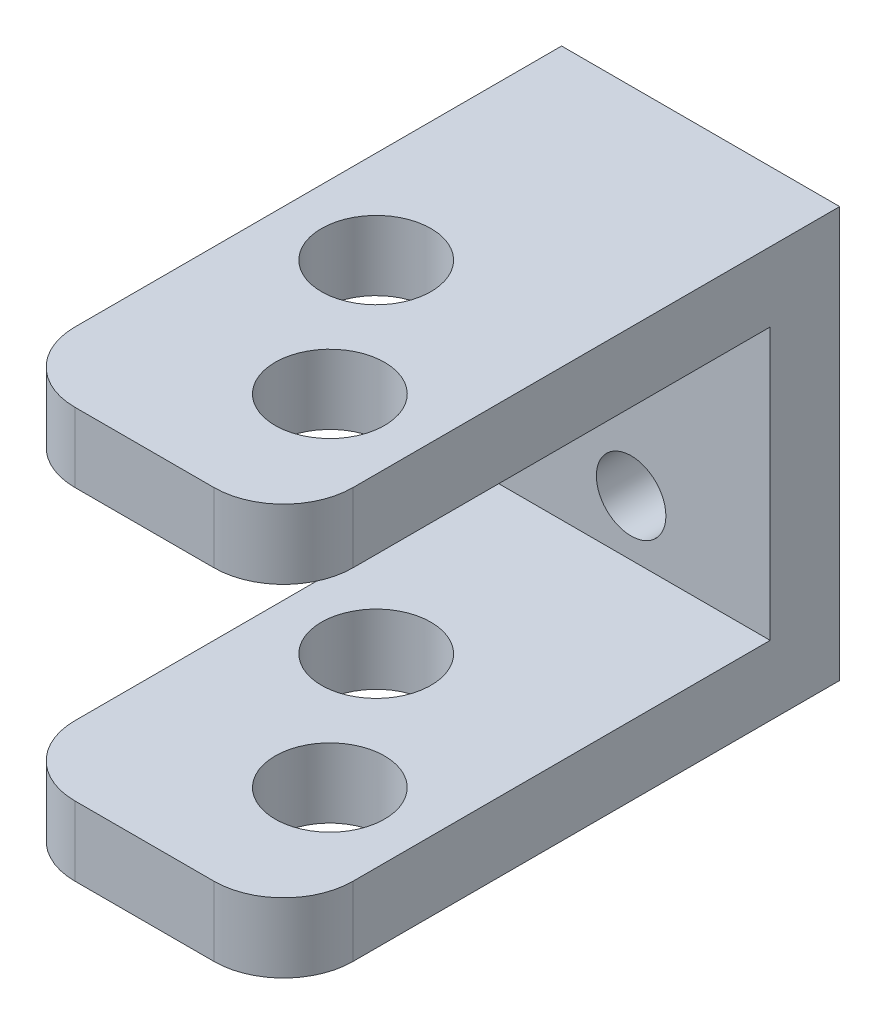
ISO-10303-21;
HEADER;
FILE_DESCRIPTION(('STEP AP214'),'2;1');
FILE_NAME('part.step','',(''),(''),'','','');
FILE_SCHEMA(('AUTOMOTIVE_DESIGN { 1 0 10303 214 1 1 1 1 }'));
ENDSEC;
DATA;
#1=APPLICATION_CONTEXT('core data for automotive mechanical design processes');
#2=APPLICATION_PROTOCOL_DEFINITION('international standard','automotive_design',2000,#1);
#3=PRODUCT_CONTEXT('',#1,'mechanical');
#4=PRODUCT('Part','Part','',(#3));
#5=PRODUCT_RELATED_PRODUCT_CATEGORY('part','',(#4));
#6=PRODUCT_DEFINITION_FORMATION('','',#4);
#7=PRODUCT_DEFINITION_CONTEXT('part definition',#1,'design');
#8=PRODUCT_DEFINITION('design','',#6,#7);
#9=PRODUCT_DEFINITION_SHAPE('','',#8);
#10=(LENGTH_UNIT() NAMED_UNIT(*) SI_UNIT(.MILLI.,.METRE.));
#11=(NAMED_UNIT(*) PLANE_ANGLE_UNIT() SI_UNIT($,.RADIAN.));
#12=(NAMED_UNIT(*) SI_UNIT($,.STERADIAN.) SOLID_ANGLE_UNIT());
#13=UNCERTAINTY_MEASURE_WITH_UNIT(LENGTH_MEASURE(1.E-05),#10,'distance_accuracy_value','');
#14=(GEOMETRIC_REPRESENTATION_CONTEXT(3) GLOBAL_UNCERTAINTY_ASSIGNED_CONTEXT((#13)) GLOBAL_UNIT_ASSIGNED_CONTEXT((#10,
#11,#12)) REPRESENTATION_CONTEXT('',''));
#15=CARTESIAN_POINT('',(0.,0.,0.));
#16=DIRECTION('',(0.,0.,1.));
#17=DIRECTION('',(1.,0.,0.));
#18=AXIS2_PLACEMENT_3D('',#15,#16,#17);
#19=CARTESIAN_POINT('',(0.,0.,6.35));
#20=DIRECTION('',(0.,0.,1.));
#21=DIRECTION('',(1.,0.,0.));
#22=AXIS2_PLACEMENT_3D('',#19,#20,#21);
#23=PLANE('',#22);
#24=CARTESIAN_POINT('',(-12.7,-11.43,6.35));
#25=DIRECTION('',(0.,0.,1.));
#26=DIRECTION('',(1.,0.,0.));
#27=AXIS2_PLACEMENT_3D('',#24,#25,#26);
#28=CIRCLE('',#27,3.175);
#29=CARTESIAN_POINT('',(-9.52500000000003,-11.43,6.35));
#30=VERTEX_POINT('',#29);
#31=EDGE_CURVE('E196',#30,#30,#28,.T.);
#32=ORIENTED_EDGE('',*,*,#31,.F.);
#33=EDGE_LOOP('',(#32));
#34=FACE_BOUND('',#33,.T.);
#35=CARTESIAN_POINT('',(-12.7,-26.058235472158,6.35));
#36=DIRECTION('',(0.,0.,1.));
#37=DIRECTION('',(1.,0.,0.));
#38=AXIS2_PLACEMENT_3D('',#35,#36,#37);
#39=CIRCLE('',#38,3.175);
#40=CARTESIAN_POINT('',(-9.52500000000003,-26.058235472158,6.35));
#41=VERTEX_POINT('',#40);
#42=EDGE_CURVE('E260',#41,#41,#39,.T.);
#43=ORIENTED_EDGE('',*,*,#42,.F.);
#44=EDGE_LOOP('',(#43));
#45=FACE_BOUND('',#44,.T.);
#46=DIRECTION('',(0.,-1.,0.));
#47=VECTOR('',#46,1.);
#48=CARTESIAN_POINT('',(-25.4,0.,6.35));
#49=LINE('',#48,#47);
#50=CARTESIAN_POINT('',(-25.4,-6.35,6.35));
#51=VERTEX_POINT('',#50);
#52=CARTESIAN_POINT('',(-25.4,-31.138235472158,6.35));
#53=VERTEX_POINT('',#52);
#54=EDGE_CURVE('E132',#51,#53,#49,.T.);
#55=ORIENTED_EDGE('',*,*,#54,.T.);
#56=DIRECTION('',(-1.,0.,0.));
#57=VECTOR('',#56,1.);
#58=CARTESIAN_POINT('',(-25.4,-31.138235472158,6.35));
#59=LINE('',#58,#57);
#60=CARTESIAN_POINT('',(0.,-31.138235472158,6.35));
#61=VERTEX_POINT('',#60);
#62=EDGE_CURVE('E141',#61,#53,#59,.T.);
#63=ORIENTED_EDGE('',*,*,#62,.F.);
#64=DIRECTION('',(0.,-1.,0.));
#65=VECTOR('',#64,1.);
#66=CARTESIAN_POINT('',(0.,0.,6.35));
#67=LINE('',#66,#65);
#68=CARTESIAN_POINT('',(0.,-6.35,6.35));
#69=VERTEX_POINT('',#68);
#70=EDGE_CURVE('E157',#69,#61,#67,.T.);
#71=ORIENTED_EDGE('',*,*,#70,.F.);
#72=DIRECTION('',(1.,0.,0.));
#73=VECTOR('',#72,1.);
#74=CARTESIAN_POINT('',(0.,-6.35,6.35));
#75=LINE('',#74,#73);
#76=EDGE_CURVE('E154',#51,#69,#75,.T.);
#77=ORIENTED_EDGE('',*,*,#76,.F.);
#78=EDGE_LOOP('',(#55,#63,#71,#77));
#79=FACE_BOUND('',#78,.T.);
#80=ADVANCED_FACE('F40',(#34,#45,#79),#23,.T.);
#81=CARTESIAN_POINT('',(0.,0.,6.35));
#82=DIRECTION('',(1.,0.,0.));
#83=DIRECTION('',(0.,1.,0.));
#84=AXIS2_PLACEMENT_3D('',#81,#82,#83);
#85=PLANE('',#84);
#86=DIRECTION('',(0.,0.,-1.));
#87=VECTOR('',#86,1.);
#88=CARTESIAN_POINT('',(-8.67212955327729E-12,-31.138235472158,50.8));
#89=LINE('',#88,#87);
#90=CARTESIAN_POINT('',(-8.67212955327729E-12,-31.138235472158,44.45));
#91=VERTEX_POINT('',#90);
#92=EDGE_CURVE('E137',#91,#61,#89,.T.);
#93=ORIENTED_EDGE('',*,*,#92,.F.);
#94=DIRECTION('',(0.,1.,0.));
#95=VECTOR('',#94,1.);
#96=CARTESIAN_POINT('',(0.,-37.488235472158,44.45));
#97=LINE('',#96,#95);
#98=CARTESIAN_POINT('',(-8.74753937398346E-12,-37.4882354721581,44.45));
#99=VERTEX_POINT('',#98);
#100=EDGE_CURVE('E227',#91,#99,#97,.F.);
#101=ORIENTED_EDGE('',*,*,#100,.T.);
#102=DIRECTION('',(0.,0.,-1.));
#103=VECTOR('',#102,1.);
#104=CARTESIAN_POINT('',(-8.74753937398346E-12,-37.4882354721581,6.35));
#105=LINE('',#104,#103);
#106=CARTESIAN_POINT('',(-8.74753937398346E-12,-37.4882354721581,0.));
#107=VERTEX_POINT('',#106);
#108=EDGE_CURVE('E156',#99,#107,#105,.T.);
#109=ORIENTED_EDGE('',*,*,#108,.T.);
#110=DIRECTION('',(0.,-1.,0.));
#111=VECTOR('',#110,1.);
#112=CARTESIAN_POINT('',(0.,0.,0.));
#113=LINE('',#112,#111);
#114=CARTESIAN_POINT('',(-8.67212955327729E-12,0.,0.));
#115=VERTEX_POINT('',#114);
#116=EDGE_CURVE('E169',#115,#107,#113,.T.);
#117=ORIENTED_EDGE('',*,*,#116,.F.);
#118=DIRECTION('',(0.,0.,-1.));
#119=VECTOR('',#118,1.);
#120=CARTESIAN_POINT('',(-8.67212955327729E-12,0.,6.35));
#121=LINE('',#120,#119);
#122=CARTESIAN_POINT('',(-8.67212955327729E-12,0.,44.45));
#123=VERTEX_POINT('',#122);
#124=EDGE_CURVE('E189',#123,#115,#121,.T.);
#125=ORIENTED_EDGE('',*,*,#124,.F.);
#126=DIRECTION('',(0.,1.,0.));
#127=VECTOR('',#126,1.);
#128=CARTESIAN_POINT('',(0.,-6.35,44.45));
#129=LINE('',#128,#127);
#130=CARTESIAN_POINT('',(0.,-6.35,44.45));
#131=VERTEX_POINT('',#130);
#132=EDGE_CURVE('E224',#123,#131,#129,.F.);
#133=ORIENTED_EDGE('',*,*,#132,.T.);
#134=DIRECTION('',(0.,0.,-1.));
#135=VECTOR('',#134,1.);
#136=CARTESIAN_POINT('',(0.,-6.35,50.8));
#137=LINE('',#136,#135);
#138=EDGE_CURVE('E295',#131,#69,#137,.T.);
#139=ORIENTED_EDGE('',*,*,#138,.T.);
#140=ORIENTED_EDGE('',*,*,#70,.T.);
#141=EDGE_LOOP('',(#93,#101,#109,#117,#125,#133,#139,#140));
#142=FACE_BOUND('',#141,.T.);
#143=ADVANCED_FACE('F318',(#142),#85,.T.);
#144=CARTESIAN_POINT('',(0.,0.,6.35));
#145=DIRECTION('',(0.,1.,0.));
#146=DIRECTION('',(-1.,0.,0.));
#147=AXIS2_PLACEMENT_3D('',#144,#145,#146);
#148=PLANE('',#147);
#149=CARTESIAN_POINT('',(-16.9333333333323,2.0122792321331E-13,25.4));
#150=DIRECTION('',(0.,1.,0.));
#151=DIRECTION('',(-1.,0.,0.));
#152=AXIS2_PLACEMENT_3D('',#149,#150,#151);
#153=CIRCLE('',#152,5.00000000001011);
#154=CARTESIAN_POINT('',(-21.9333333333424,2.60645617075648E-13,25.4));
#155=VERTEX_POINT('',#154);
#156=EDGE_CURVE('E263',#155,#155,#153,.T.);
#157=ORIENTED_EDGE('',*,*,#156,.F.);
#158=EDGE_LOOP('',(#157));
#159=FACE_BOUND('',#158,.T.);
#160=CARTESIAN_POINT('',(-8.46666666666551,1.00613961606655E-13,38.1));
#161=DIRECTION('',(0.,1.,0.));
#162=DIRECTION('',(-1.,0.,0.));
#163=AXIS2_PLACEMENT_3D('',#160,#161,#162);
#164=CIRCLE('',#163,5.00000000001011);
#165=CARTESIAN_POINT('',(-13.4666666666756,1.60031655468993E-13,38.1));
#166=VERTEX_POINT('',#165);
#167=EDGE_CURVE('E272',#166,#166,#164,.T.);
#168=ORIENTED_EDGE('',*,*,#167,.F.);
#169=EDGE_LOOP('',(#168));
#170=FACE_BOUND('',#169,.T.);
#171=DIRECTION('',(-1.,0.,0.));
#172=VECTOR('',#171,1.);
#173=CARTESIAN_POINT('',(0.,0.,50.8));
#174=LINE('',#173,#172);
#175=CARTESIAN_POINT('',(-6.35,0.,50.8));
#176=VERTEX_POINT('',#175);
#177=CARTESIAN_POINT('',(-19.05,0.,50.8));
#178=VERTEX_POINT('',#177);
#179=EDGE_CURVE('E257',#176,#178,#174,.T.);
#180=ORIENTED_EDGE('',*,*,#179,.F.);
#181=CARTESIAN_POINT('',(-6.35,0.,44.45));
#182=DIRECTION('',(0.,1.,0.));
#183=DIRECTION('',(-1.,0.,0.));
#184=AXIS2_PLACEMENT_3D('',#181,#182,#183);
#185=CIRCLE('',#184,6.35);
#186=EDGE_CURVE('E247',#176,#123,#185,.T.);
#187=ORIENTED_EDGE('',*,*,#186,.T.);
#188=ORIENTED_EDGE('',*,*,#124,.T.);
#189=DIRECTION('',(1.,0.,0.));
#190=VECTOR('',#189,1.);
#191=CARTESIAN_POINT('',(0.,0.,0.));
#192=LINE('',#191,#190);
#193=CARTESIAN_POINT('',(-25.4,3.01841884820068E-13,0.));
#194=VERTEX_POINT('',#193);
#195=EDGE_CURVE('E172',#194,#115,#192,.T.);
#196=ORIENTED_EDGE('',*,*,#195,.F.);
#197=DIRECTION('',(0.,0.,-1.));
#198=VECTOR('',#197,1.);
#199=CARTESIAN_POINT('',(-25.4,3.01841884820068E-13,6.35));
#200=LINE('',#199,#198);
#201=CARTESIAN_POINT('',(-25.4,3.01841884820068E-13,44.45));
#202=VERTEX_POINT('',#201);
#203=EDGE_CURVE('E186',#202,#194,#200,.T.);
#204=ORIENTED_EDGE('',*,*,#203,.F.);
#205=CARTESIAN_POINT('',(-19.05,2.26381413615051E-13,44.45));
#206=DIRECTION('',(0.,1.,0.));
#207=DIRECTION('',(-1.,0.,0.));
#208=AXIS2_PLACEMENT_3D('',#205,#206,#207);
#209=CIRCLE('',#208,6.35);
#210=EDGE_CURVE('E244',#202,#178,#209,.T.);
#211=ORIENTED_EDGE('',*,*,#210,.T.);
#212=EDGE_LOOP('',(#180,#187,#188,#196,#204,#211));
#213=FACE_BOUND('',#212,.T.);
#214=ADVANCED_FACE('F306',(#159,#170,#213),#148,.T.);
#215=CARTESIAN_POINT('',(-25.4,0.,6.35));
#216=DIRECTION('',(1.,0.,0.));
#217=DIRECTION('',(0.,1.,0.));
#218=AXIS2_PLACEMENT_3D('',#215,#216,#217);
#219=PLANE('',#218);
#220=DIRECTION('',(0.,0.,-1.));
#221=VECTOR('',#220,1.);
#222=CARTESIAN_POINT('',(-25.4,-37.488235472158,6.35));
#223=LINE('',#222,#221);
#224=CARTESIAN_POINT('',(-25.4,-37.488235472158,44.45));
#225=VERTEX_POINT('',#224);
#226=CARTESIAN_POINT('',(-25.4,-37.488235472158,0.));
#227=VERTEX_POINT('',#226);
#228=EDGE_CURVE('E162',#225,#227,#223,.T.);
#229=ORIENTED_EDGE('',*,*,#228,.F.);
#230=DIRECTION('',(0.,-1.,0.));
#231=VECTOR('',#230,1.);
#232=CARTESIAN_POINT('',(-25.4,0.,44.45));
#233=LINE('',#232,#231);
#234=CARTESIAN_POINT('',(-25.4,-31.138235472158,44.45));
#235=VERTEX_POINT('',#234);
#236=EDGE_CURVE('E11',#225,#235,#233,.F.);
#237=ORIENTED_EDGE('',*,*,#236,.T.);
#238=DIRECTION('',(0.,0.,-1.));
#239=VECTOR('',#238,1.);
#240=CARTESIAN_POINT('',(-25.4,-31.138235472158,50.8));
#241=LINE('',#240,#239);
#242=EDGE_CURVE('E127',#235,#53,#241,.T.);
#243=ORIENTED_EDGE('',*,*,#242,.T.);
#244=ORIENTED_EDGE('',*,*,#54,.F.);
#245=DIRECTION('',(0.,0.,-1.));
#246=VECTOR('',#245,1.);
#247=CARTESIAN_POINT('',(-25.4,-6.35,50.8));
#248=LINE('',#247,#246);
#249=CARTESIAN_POINT('',(-25.4,-6.35,44.45));
#250=VERTEX_POINT('',#249);
#251=EDGE_CURVE('E173',#250,#51,#248,.T.);
#252=ORIENTED_EDGE('',*,*,#251,.F.);
#253=DIRECTION('',(0.,-1.,0.));
#254=VECTOR('',#253,1.);
#255=CARTESIAN_POINT('',(-25.4,0.,44.45));
#256=LINE('',#255,#254);
#257=EDGE_CURVE('E49',#250,#202,#256,.F.);
#258=ORIENTED_EDGE('',*,*,#257,.T.);
#259=ORIENTED_EDGE('',*,*,#203,.T.);
#260=DIRECTION('',(0.,-1.,0.));
#261=VECTOR('',#260,1.);
#262=CARTESIAN_POINT('',(-25.4,0.,0.));
#263=LINE('',#262,#261);
#264=EDGE_CURVE('E177',#194,#227,#263,.T.);
#265=ORIENTED_EDGE('',*,*,#264,.T.);
#266=EDGE_LOOP('',(#229,#237,#243,#244,#252,#258,#259,#265));
#267=FACE_BOUND('',#266,.T.);
#268=ADVANCED_FACE('F130',(#267),#219,.F.);
#269=CARTESIAN_POINT('',(0.,-37.4882354721581,6.35));
#270=DIRECTION('',(0.,1.,0.));
#271=DIRECTION('',(-1.,0.,0.));
#272=AXIS2_PLACEMENT_3D('',#269,#270,#271);
#273=PLANE('',#272);
#274=CARTESIAN_POINT('',(-16.9333333333328,-37.4882354721582,25.4));
#275=DIRECTION('',(0.,1.,0.));
#276=DIRECTION('',(-1.,0.,0.));
#277=AXIS2_PLACEMENT_3D('',#274,#275,#276);
#278=CIRCLE('',#277,5.00000000001011);
#279=CARTESIAN_POINT('',(-21.9333333333429,-37.4882354721581,25.4));
#280=VERTEX_POINT('',#279);
#281=EDGE_CURVE('E205',#280,#280,#278,.T.);
#282=ORIENTED_EDGE('',*,*,#281,.T.);
#283=EDGE_LOOP('',(#282));
#284=FACE_BOUND('',#283,.T.);
#285=CARTESIAN_POINT('',(-8.46666666666596,-37.4882354721583,38.1));
#286=DIRECTION('',(0.,1.,0.));
#287=DIRECTION('',(-1.,0.,0.));
#288=AXIS2_PLACEMENT_3D('',#285,#286,#287);
#289=CIRCLE('',#288,5.00000000001011);
#290=CARTESIAN_POINT('',(-13.4666666666761,-37.4882354721582,38.1));
#291=VERTEX_POINT('',#290);
#292=EDGE_CURVE('E265',#291,#291,#289,.T.);
#293=ORIENTED_EDGE('',*,*,#292,.T.);
#294=EDGE_LOOP('',(#293));
#295=FACE_BOUND('',#294,.T.);
#296=ORIENTED_EDGE('',*,*,#108,.F.);
#297=CARTESIAN_POINT('',(-6.35000000000008,-37.4882354721581,44.45));
#298=DIRECTION('',(0.,1.,0.));
#299=DIRECTION('',(-1.,0.,0.));
#300=AXIS2_PLACEMENT_3D('',#297,#298,#299);
#301=CIRCLE('',#300,6.35);
#302=CARTESIAN_POINT('',(-6.35000000000007,-37.488235472158,50.8));
#303=VERTEX_POINT('',#302);
#304=EDGE_CURVE('E233',#99,#303,#301,.F.);
#305=ORIENTED_EDGE('',*,*,#304,.T.);
#306=DIRECTION('',(1.,0.,0.));
#307=VECTOR('',#306,1.);
#308=CARTESIAN_POINT('',(-25.4,-37.488235472158,50.8));
#309=LINE('',#308,#307);
#310=CARTESIAN_POINT('',(-19.05,-37.488235472158,50.8));
#311=VERTEX_POINT('',#310);
#312=EDGE_CURVE('E149',#311,#303,#309,.T.);
#313=ORIENTED_EDGE('',*,*,#312,.F.);
#314=CARTESIAN_POINT('',(-19.05,-37.488235472158,44.45));
#315=DIRECTION('',(0.,1.,0.));
#316=DIRECTION('',(-1.,0.,0.));
#317=AXIS2_PLACEMENT_3D('',#314,#315,#316);
#318=CIRCLE('',#317,6.35);
#319=EDGE_CURVE('E230',#311,#225,#318,.F.);
#320=ORIENTED_EDGE('',*,*,#319,.T.);
#321=ORIENTED_EDGE('',*,*,#228,.T.);
#322=DIRECTION('',(1.,0.,0.));
#323=VECTOR('',#322,1.);
#324=CARTESIAN_POINT('',(0.,-37.4882354721581,0.));
#325=LINE('',#324,#323);
#326=EDGE_CURVE('E165',#227,#107,#325,.T.);
#327=ORIENTED_EDGE('',*,*,#326,.T.);
#328=EDGE_LOOP('',(#296,#305,#313,#320,#321,#327));
#329=FACE_BOUND('',#328,.T.);
#330=ADVANCED_FACE('F333',(#284,#295,#329),#273,.F.);
#331=CARTESIAN_POINT('',(0.,0.,0.));
#332=DIRECTION('',(0.,0.,1.));
#333=DIRECTION('',(1.,0.,0.));
#334=AXIS2_PLACEMENT_3D('',#331,#332,#333);
#335=PLANE('',#334);
#336=CARTESIAN_POINT('',(-12.7,-11.43,0.));
#337=DIRECTION('',(0.,0.,1.));
#338=DIRECTION('',(1.,0.,0.));
#339=AXIS2_PLACEMENT_3D('',#336,#337,#338);
#340=CIRCLE('',#339,3.175);
#341=CARTESIAN_POINT('',(-9.52500000000003,-11.43,0.));
#342=VERTEX_POINT('',#341);
#343=EDGE_CURVE('E150',#342,#342,#340,.T.);
#344=ORIENTED_EDGE('',*,*,#343,.T.);
#345=EDGE_LOOP('',(#344));
#346=FACE_BOUND('',#345,.T.);
#347=CARTESIAN_POINT('',(-12.7,-26.058235472158,0.));
#348=DIRECTION('',(0.,0.,1.));
#349=DIRECTION('',(1.,0.,0.));
#350=AXIS2_PLACEMENT_3D('',#347,#348,#349);
#351=CIRCLE('',#350,3.175);
#352=CARTESIAN_POINT('',(-9.52500000000003,-26.058235472158,0.));
#353=VERTEX_POINT('',#352);
#354=EDGE_CURVE('E193',#353,#353,#351,.T.);
#355=ORIENTED_EDGE('',*,*,#354,.T.);
#356=EDGE_LOOP('',(#355));
#357=FACE_BOUND('',#356,.T.);
#358=ORIENTED_EDGE('',*,*,#116,.T.);
#359=ORIENTED_EDGE('',*,*,#326,.F.);
#360=ORIENTED_EDGE('',*,*,#264,.F.);
#361=ORIENTED_EDGE('',*,*,#195,.T.);
#362=EDGE_LOOP('',(#358,#359,#360,#361));
#363=FACE_BOUND('',#362,.T.);
#364=ADVANCED_FACE('F323',(#346,#357,#363),#335,.F.);
#365=CARTESIAN_POINT('',(0.,-6.35,50.8));
#366=DIRECTION('',(0.,1.,0.));
#367=DIRECTION('',(-1.,0.,0.));
#368=AXIS2_PLACEMENT_3D('',#365,#366,#367);
#369=PLANE('',#368);
#370=CARTESIAN_POINT('',(-16.9333333333324,-6.35,25.4));
#371=DIRECTION('',(0.,1.,0.));
#372=DIRECTION('',(-1.,0.,0.));
#373=AXIS2_PLACEMENT_3D('',#370,#371,#372);
#374=CIRCLE('',#373,5.00000000001011);
#375=CARTESIAN_POINT('',(-21.9333333333425,-6.35000000000001,25.4));
#376=VERTEX_POINT('',#375);
#377=EDGE_CURVE('E210',#376,#376,#374,.T.);
#378=ORIENTED_EDGE('',*,*,#377,.T.);
#379=EDGE_LOOP('',(#378));
#380=FACE_BOUND('',#379,.T.);
#381=CARTESIAN_POINT('',(-8.46666666666559,-6.35,38.1));
#382=DIRECTION('',(0.,1.,0.));
#383=DIRECTION('',(-1.,0.,0.));
#384=AXIS2_PLACEMENT_3D('',#381,#382,#383);
#385=CIRCLE('',#384,5.00000000001011);
#386=CARTESIAN_POINT('',(-13.4666666666757,-6.35,38.1));
#387=VERTEX_POINT('',#386);
#388=EDGE_CURVE('E204',#387,#387,#385,.T.);
#389=ORIENTED_EDGE('',*,*,#388,.T.);
#390=EDGE_LOOP('',(#389));
#391=FACE_BOUND('',#390,.T.);
#392=ORIENTED_EDGE('',*,*,#138,.F.);
#393=CARTESIAN_POINT('',(-6.35000000000001,-6.35,44.45));
#394=DIRECTION('',(0.,1.,0.));
#395=DIRECTION('',(-1.,0.,0.));
#396=AXIS2_PLACEMENT_3D('',#393,#394,#395);
#397=CIRCLE('',#396,6.35);
#398=CARTESIAN_POINT('',(-6.35000000000001,-6.35,50.8));
#399=VERTEX_POINT('',#398);
#400=EDGE_CURVE('E252',#131,#399,#397,.F.);
#401=ORIENTED_EDGE('',*,*,#400,.T.);
#402=DIRECTION('',(1.,0.,0.));
#403=VECTOR('',#402,1.);
#404=CARTESIAN_POINT('',(0.,-6.35,50.8));
#405=LINE('',#404,#403);
#406=CARTESIAN_POINT('',(-19.05,-6.35,50.8));
#407=VERTEX_POINT('',#406);
#408=EDGE_CURVE('E292',#407,#399,#405,.T.);
#409=ORIENTED_EDGE('',*,*,#408,.F.);
#410=CARTESIAN_POINT('',(-19.05,-6.35,44.45));
#411=DIRECTION('',(0.,1.,0.));
#412=DIRECTION('',(-1.,0.,0.));
#413=AXIS2_PLACEMENT_3D('',#410,#411,#412);
#414=CIRCLE('',#413,6.35);
#415=EDGE_CURVE('E56',#407,#250,#414,.F.);
#416=ORIENTED_EDGE('',*,*,#415,.T.);
#417=ORIENTED_EDGE('',*,*,#251,.T.);
#418=ORIENTED_EDGE('',*,*,#76,.T.);
#419=EDGE_LOOP('',(#392,#401,#409,#416,#417,#418));
#420=FACE_BOUND('',#419,.T.);
#421=ADVANCED_FACE('F300',(#380,#391,#420),#369,.F.);
#422=CARTESIAN_POINT('',(0.,0.,50.8));
#423=DIRECTION('',(0.,0.,-1.));
#424=DIRECTION('',(-1.,0.,0.));
#425=AXIS2_PLACEMENT_3D('',#422,#423,#424);
#426=PLANE('',#425);
#427=ORIENTED_EDGE('',*,*,#408,.T.);
#428=DIRECTION('',(0.,1.,0.));
#429=VECTOR('',#428,1.);
#430=CARTESIAN_POINT('',(-6.35,0.,50.8));
#431=LINE('',#430,#429);
#432=EDGE_CURVE('E240',#399,#176,#431,.T.);
#433=ORIENTED_EDGE('',*,*,#432,.T.);
#434=ORIENTED_EDGE('',*,*,#179,.T.);
#435=DIRECTION('',(0.,-1.,0.));
#436=VECTOR('',#435,1.);
#437=CARTESIAN_POINT('',(-19.05,0.,50.8));
#438=LINE('',#437,#436);
#439=EDGE_CURVE('E236',#178,#407,#438,.T.);
#440=ORIENTED_EDGE('',*,*,#439,.T.);
#441=EDGE_LOOP('',(#427,#433,#434,#440));
#442=FACE_BOUND('',#441,.T.);
#443=ADVANCED_FACE('F309',(#442),#426,.F.);
#444=CARTESIAN_POINT('',(-25.4,-31.138235472158,50.8));
#445=DIRECTION('',(0.,-1.,0.));
#446=DIRECTION('',(0.,0.,-1.));
#447=AXIS2_PLACEMENT_3D('',#444,#445,#446);
#448=PLANE('',#447);
#449=CARTESIAN_POINT('',(-16.9333333333327,-31.138235472158,25.4));
#450=DIRECTION('',(0.,-1.,0.));
#451=DIRECTION('',(0.,0.,-1.));
#452=AXIS2_PLACEMENT_3D('',#449,#450,#451);
#453=CIRCLE('',#452,5.00000000001011);
#454=CARTESIAN_POINT('',(-16.9333333333327,-31.138235472158,20.3999999999899));
#455=VERTEX_POINT('',#454);
#456=EDGE_CURVE('E206',#455,#455,#453,.T.);
#457=ORIENTED_EDGE('',*,*,#456,.T.);
#458=EDGE_LOOP('',(#457));
#459=FACE_BOUND('',#458,.T.);
#460=CARTESIAN_POINT('',(-8.46666666666588,-31.138235472158,38.1));
#461=DIRECTION('',(0.,-1.,0.));
#462=DIRECTION('',(0.,0.,-1.));
#463=AXIS2_PLACEMENT_3D('',#460,#461,#462);
#464=CIRCLE('',#463,5.00000000001011);
#465=CARTESIAN_POINT('',(-8.46666666666588,-31.138235472158,33.0999999999899));
#466=VERTEX_POINT('',#465);
#467=EDGE_CURVE('E200',#466,#466,#464,.T.);
#468=ORIENTED_EDGE('',*,*,#467,.T.);
#469=EDGE_LOOP('',(#468));
#470=FACE_BOUND('',#469,.T.);
#471=DIRECTION('',(-1.,0.,0.));
#472=VECTOR('',#471,1.);
#473=CARTESIAN_POINT('',(-25.4,-31.138235472158,50.8));
#474=LINE('',#473,#472);
#475=CARTESIAN_POINT('',(-6.35000000000006,-31.138235472158,50.8));
#476=VERTEX_POINT('',#475);
#477=CARTESIAN_POINT('',(-19.05,-31.138235472158,50.8));
#478=VERTEX_POINT('',#477);
#479=EDGE_CURVE('E138',#476,#478,#474,.T.);
#480=ORIENTED_EDGE('',*,*,#479,.F.);
#481=CARTESIAN_POINT('',(-6.35000000000006,-31.138235472158,44.45));
#482=DIRECTION('',(0.,-1.,0.));
#483=DIRECTION('',(0.,0.,-1.));
#484=AXIS2_PLACEMENT_3D('',#481,#482,#483);
#485=CIRCLE('',#484,6.35);
#486=EDGE_CURVE('E221',#476,#91,#485,.F.);
#487=ORIENTED_EDGE('',*,*,#486,.T.);
#488=ORIENTED_EDGE('',*,*,#92,.T.);
#489=ORIENTED_EDGE('',*,*,#62,.T.);
#490=ORIENTED_EDGE('',*,*,#242,.F.);
#491=CARTESIAN_POINT('',(-19.05,-31.138235472158,44.45));
#492=DIRECTION('',(0.,-1.,0.));
#493=DIRECTION('',(0.,0.,-1.));
#494=AXIS2_PLACEMENT_3D('',#491,#492,#493);
#495=CIRCLE('',#494,6.35);
#496=EDGE_CURVE('E218',#235,#478,#495,.F.);
#497=ORIENTED_EDGE('',*,*,#496,.T.);
#498=EDGE_LOOP('',(#480,#487,#488,#489,#490,#497));
#499=FACE_BOUND('',#498,.T.);
#500=ADVANCED_FACE('F143',(#459,#470,#499),#448,.F.);
#501=CARTESIAN_POINT('',(0.,0.,50.8));
#502=DIRECTION('',(0.,0.,-1.));
#503=DIRECTION('',(-1.,0.,0.));
#504=AXIS2_PLACEMENT_3D('',#501,#502,#503);
#505=PLANE('',#504);
#506=ORIENTED_EDGE('',*,*,#312,.T.);
#507=DIRECTION('',(0.,1.,0.));
#508=VECTOR('',#507,1.);
#509=CARTESIAN_POINT('',(-6.35000000000006,-31.138235472158,50.8));
#510=LINE('',#509,#508);
#511=EDGE_CURVE('E214',#303,#476,#510,.T.);
#512=ORIENTED_EDGE('',*,*,#511,.T.);
#513=ORIENTED_EDGE('',*,*,#479,.T.);
#514=DIRECTION('',(0.,-1.,0.));
#515=VECTOR('',#514,1.);
#516=CARTESIAN_POINT('',(-19.05,0.,50.8));
#517=LINE('',#516,#515);
#518=EDGE_CURVE('E192',#478,#311,#517,.T.);
#519=ORIENTED_EDGE('',*,*,#518,.T.);
#520=EDGE_LOOP('',(#506,#512,#513,#519));
#521=FACE_BOUND('',#520,.T.);
#522=ADVANCED_FACE('F328',(#521),#505,.F.);
#523=CARTESIAN_POINT('',(-12.7,-26.058235472158,-31.75));
#524=DIRECTION('',(0.,0.,1.));
#525=DIRECTION('',(1.,0.,0.));
#526=AXIS2_PLACEMENT_3D('',#523,#524,#525);
#527=CYLINDRICAL_SURFACE('',#526,3.175);
#528=ORIENTED_EDGE('',*,*,#42,.T.);
#529=EDGE_LOOP('',(#528));
#530=FACE_BOUND('',#529,.T.);
#531=ORIENTED_EDGE('',*,*,#354,.F.);
#532=EDGE_LOOP('',(#531));
#533=FACE_BOUND('',#532,.T.);
#534=ADVANCED_FACE('F366',(#530,#533),#527,.F.);
#535=CARTESIAN_POINT('',(-12.7,-11.43,-31.75));
#536=DIRECTION('',(0.,0.,1.));
#537=DIRECTION('',(1.,0.,0.));
#538=AXIS2_PLACEMENT_3D('',#535,#536,#537);
#539=CYLINDRICAL_SURFACE('',#538,3.175);
#540=ORIENTED_EDGE('',*,*,#31,.T.);
#541=EDGE_LOOP('',(#540));
#542=FACE_BOUND('',#541,.T.);
#543=ORIENTED_EDGE('',*,*,#343,.F.);
#544=EDGE_LOOP('',(#543));
#545=FACE_BOUND('',#544,.T.);
#546=ADVANCED_FACE('F369',(#542,#545),#539,.F.);
#547=CARTESIAN_POINT('',(-8.46666666666596,-37.4882354721583,38.1));
#548=DIRECTION('',(0.,1.,0.));
#549=DIRECTION('',(-1.,0.,0.));
#550=AXIS2_PLACEMENT_3D('',#547,#548,#549);
#551=CYLINDRICAL_SURFACE('',#550,5.00000000001011);
#552=ORIENTED_EDGE('',*,*,#292,.F.);
#553=EDGE_LOOP('',(#552));
#554=FACE_BOUND('',#553,.T.);
#555=ORIENTED_EDGE('',*,*,#467,.F.);
#556=EDGE_LOOP('',(#555));
#557=FACE_BOUND('',#556,.T.);
#558=ADVANCED_FACE('F373',(#554,#557),#551,.F.);
#559=CARTESIAN_POINT('',(-16.9333333333328,-37.4882354721582,25.4));
#560=DIRECTION('',(0.,1.,0.));
#561=DIRECTION('',(-1.,0.,0.));
#562=AXIS2_PLACEMENT_3D('',#559,#560,#561);
#563=CYLINDRICAL_SURFACE('',#562,5.00000000001011);
#564=ORIENTED_EDGE('',*,*,#281,.F.);
#565=EDGE_LOOP('',(#564));
#566=FACE_BOUND('',#565,.T.);
#567=ORIENTED_EDGE('',*,*,#456,.F.);
#568=EDGE_LOOP('',(#567));
#569=FACE_BOUND('',#568,.T.);
#570=ADVANCED_FACE('F379',(#566,#569),#563,.F.);
#571=ORIENTED_EDGE('',*,*,#167,.T.);
#572=EDGE_LOOP('',(#571));
#573=FACE_BOUND('',#572,.T.);
#574=ORIENTED_EDGE('',*,*,#388,.F.);
#575=EDGE_LOOP('',(#574));
#576=FACE_BOUND('',#575,.T.);
#577=ADVANCED_FACE('F375',(#573,#576),#551,.F.);
#578=ORIENTED_EDGE('',*,*,#156,.T.);
#579=EDGE_LOOP('',(#578));
#580=FACE_BOUND('',#579,.T.);
#581=ORIENTED_EDGE('',*,*,#377,.F.);
#582=EDGE_LOOP('',(#581));
#583=FACE_BOUND('',#582,.T.);
#584=ADVANCED_FACE('F378',(#580,#583),#563,.F.);
#585=CARTESIAN_POINT('',(-6.35,0.,44.45));
#586=DIRECTION('',(0.,-1.,0.));
#587=DIRECTION('',(1.,0.,0.));
#588=AXIS2_PLACEMENT_3D('',#585,#586,#587);
#589=CYLINDRICAL_SURFACE('',#588,6.35);
#590=ORIENTED_EDGE('',*,*,#304,.F.);
#591=ORIENTED_EDGE('',*,*,#100,.F.);
#592=ORIENTED_EDGE('',*,*,#486,.F.);
#593=ORIENTED_EDGE('',*,*,#511,.F.);
#594=EDGE_LOOP('',(#590,#591,#592,#593));
#595=FACE_BOUND('',#594,.T.);
#596=ADVANCED_FACE('F331',(#595),#589,.T.);
#597=CARTESIAN_POINT('',(-6.35,0.,44.45));
#598=DIRECTION('',(0.,-1.,0.));
#599=DIRECTION('',(1.,0.,0.));
#600=AXIS2_PLACEMENT_3D('',#597,#598,#599);
#601=CYLINDRICAL_SURFACE('',#600,6.35);
#602=ORIENTED_EDGE('',*,*,#400,.F.);
#603=ORIENTED_EDGE('',*,*,#132,.F.);
#604=ORIENTED_EDGE('',*,*,#186,.F.);
#605=ORIENTED_EDGE('',*,*,#432,.F.);
#606=EDGE_LOOP('',(#602,#603,#604,#605));
#607=FACE_BOUND('',#606,.T.);
#608=ADVANCED_FACE('F313',(#607),#601,.T.);
#609=CARTESIAN_POINT('',(-19.05,0.,44.45));
#610=DIRECTION('',(0.,-1.,0.));
#611=DIRECTION('',(1.,0.,0.));
#612=AXIS2_PLACEMENT_3D('',#609,#610,#611);
#613=CYLINDRICAL_SURFACE('',#612,6.35);
#614=ORIENTED_EDGE('',*,*,#496,.F.);
#615=ORIENTED_EDGE('',*,*,#236,.F.);
#616=ORIENTED_EDGE('',*,*,#319,.F.);
#617=ORIENTED_EDGE('',*,*,#518,.F.);
#618=EDGE_LOOP('',(#614,#615,#616,#617));
#619=FACE_BOUND('',#618,.T.);
#620=ADVANCED_FACE('F326',(#619),#613,.T.);
#621=CARTESIAN_POINT('',(-19.05,0.,44.45));
#622=DIRECTION('',(0.,-1.,0.));
#623=DIRECTION('',(1.,0.,0.));
#624=AXIS2_PLACEMENT_3D('',#621,#622,#623);
#625=CYLINDRICAL_SURFACE('',#624,6.35);
#626=ORIENTED_EDGE('',*,*,#210,.F.);
#627=ORIENTED_EDGE('',*,*,#257,.F.);
#628=ORIENTED_EDGE('',*,*,#415,.F.);
#629=ORIENTED_EDGE('',*,*,#439,.F.);
#630=EDGE_LOOP('',(#626,#627,#628,#629));
#631=FACE_BOUND('',#630,.T.);
#632=ADVANCED_FACE('F42',(#631),#625,.T.);
#633=CLOSED_SHELL('',(#80,#143,#214,#268,#330,#364,#421,#443,#500,#522,#534,#546,#558,#570,#577,
#584,#596,#608,#620,#632));
#634=MANIFOLD_SOLID_BREP('B2',#633);
#635=ADVANCED_BREP_SHAPE_REPRESENTATION('',(#18,#634),#14);
#636=SHAPE_DEFINITION_REPRESENTATION(#9,#635);
ENDSEC;
END-ISO-10303-21;
